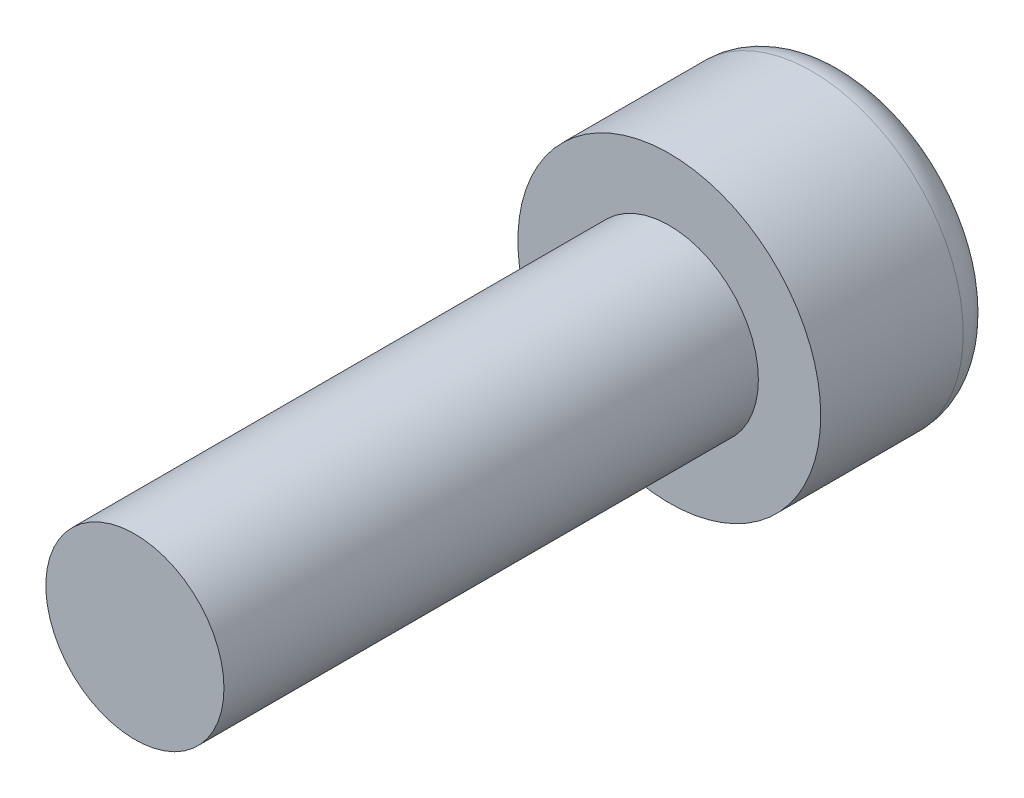
ISO-10303-21;
HEADER;
FILE_DESCRIPTION(('STEP AP214'),'2;1');
FILE_NAME('part.step','',(''),(''),'','','');
FILE_SCHEMA(('AUTOMOTIVE_DESIGN { 1 0 10303 214 1 1 1 1 }'));
ENDSEC;
DATA;
#1=APPLICATION_CONTEXT('core data for automotive mechanical design processes');
#2=APPLICATION_PROTOCOL_DEFINITION('international standard','automotive_design',2000,#1);
#3=PRODUCT_CONTEXT('',#1,'mechanical');
#4=PRODUCT('Part','Part','',(#3));
#5=PRODUCT_RELATED_PRODUCT_CATEGORY('part','',(#4));
#6=PRODUCT_DEFINITION_FORMATION('','',#4);
#7=PRODUCT_DEFINITION_CONTEXT('part definition',#1,'design');
#8=PRODUCT_DEFINITION('design','',#6,#7);
#9=PRODUCT_DEFINITION_SHAPE('','',#8);
#10=(LENGTH_UNIT() NAMED_UNIT(*) SI_UNIT(.MILLI.,.METRE.));
#11=(NAMED_UNIT(*) PLANE_ANGLE_UNIT() SI_UNIT($,.RADIAN.));
#12=(NAMED_UNIT(*) SI_UNIT($,.STERADIAN.) SOLID_ANGLE_UNIT());
#13=UNCERTAINTY_MEASURE_WITH_UNIT(LENGTH_MEASURE(1.E-05),#10,'distance_accuracy_value','');
#14=(GEOMETRIC_REPRESENTATION_CONTEXT(3) GLOBAL_UNCERTAINTY_ASSIGNED_CONTEXT((#13)) GLOBAL_UNIT_ASSIGNED_CONTEXT((#10,
#11,#12)) REPRESENTATION_CONTEXT('',''));
#15=CARTESIAN_POINT('',(0.,0.,0.));
#16=DIRECTION('',(0.,0.,1.));
#17=DIRECTION('',(1.,0.,0.));
#18=AXIS2_PLACEMENT_3D('',#15,#16,#17);
#19=CARTESIAN_POINT('',(0.,0.,5.));
#20=DIRECTION('',(0.,0.,-1.));
#21=DIRECTION('',(-1.,0.,0.));
#22=AXIS2_PLACEMENT_3D('',#19,#20,#21);
#23=CYLINDRICAL_SURFACE('',#22,4.25);
#24=CARTESIAN_POINT('',(0.,0.,1.));
#25=DIRECTION('',(0.,0.,1.));
#26=DIRECTION('',(1.,0.,0.));
#27=AXIS2_PLACEMENT_3D('',#24,#25,#26);
#28=CIRCLE('',#27,4.25);
#29=CARTESIAN_POINT('',(4.25,0.,1.));
#30=VERTEX_POINT('',#29);
#31=EDGE_CURVE('E39',#30,#30,#28,.T.);
#32=ORIENTED_EDGE('',*,*,#31,.T.);
#33=EDGE_LOOP('',(#32));
#34=FACE_BOUND('',#33,.T.);
#35=CARTESIAN_POINT('',(0.,0.,5.));
#36=DIRECTION('',(0.,0.,1.));
#37=DIRECTION('',(1.,0.,0.));
#38=AXIS2_PLACEMENT_3D('',#35,#36,#37);
#39=CIRCLE('',#38,4.25);
#40=CARTESIAN_POINT('',(4.25,0.,5.));
#41=VERTEX_POINT('',#40);
#42=EDGE_CURVE('E47',#41,#41,#39,.T.);
#43=ORIENTED_EDGE('',*,*,#42,.F.);
#44=EDGE_LOOP('',(#43));
#45=FACE_BOUND('',#44,.T.);
#46=ADVANCED_FACE('F32',(#34,#45),#23,.T.);
#47=CARTESIAN_POINT('',(0.,0.,5.));
#48=DIRECTION('',(0.,0.,1.));
#49=DIRECTION('',(1.,0.,0.));
#50=AXIS2_PLACEMENT_3D('',#47,#48,#49);
#51=PLANE('',#50);
#52=CARTESIAN_POINT('',(0.,0.,5.));
#53=DIRECTION('',(0.,0.,1.));
#54=DIRECTION('',(1.,0.,0.));
#55=AXIS2_PLACEMENT_3D('',#52,#53,#54);
#56=CIRCLE('',#55,2.5);
#57=CARTESIAN_POINT('',(2.5,0.,5.));
#58=VERTEX_POINT('',#57);
#59=EDGE_CURVE('E43',#58,#58,#56,.T.);
#60=ORIENTED_EDGE('',*,*,#59,.F.);
#61=EDGE_LOOP('',(#60));
#62=FACE_BOUND('',#61,.T.);
#63=ORIENTED_EDGE('',*,*,#42,.T.);
#64=EDGE_LOOP('',(#63));
#65=FACE_BOUND('',#64,.T.);
#66=ADVANCED_FACE('F65',(#62,#65),#51,.T.);
#67=CARTESIAN_POINT('',(0.,0.,0.));
#68=DIRECTION('',(0.,0.,1.));
#69=DIRECTION('',(1.,0.,0.));
#70=AXIS2_PLACEMENT_3D('',#67,#68,#69);
#71=PLANE('',#70);
#72=CARTESIAN_POINT('',(0.,0.,0.));
#73=DIRECTION('',(0.,0.,1.));
#74=DIRECTION('',(1.,0.,0.));
#75=AXIS2_PLACEMENT_3D('',#72,#73,#74);
#76=CIRCLE('',#75,3.25);
#77=CARTESIAN_POINT('',(3.25,0.,0.));
#78=VERTEX_POINT('',#77);
#79=EDGE_CURVE('E10',#78,#78,#76,.F.);
#80=ORIENTED_EDGE('',*,*,#79,.T.);
#81=EDGE_LOOP('',(#80));
#82=FACE_BOUND('',#81,.T.);
#83=ADVANCED_FACE('F61',(#82),#71,.F.);
#84=CARTESIAN_POINT('',(0.,0.,20.));
#85=DIRECTION('',(0.,0.,-1.));
#86=DIRECTION('',(-1.,0.,0.));
#87=AXIS2_PLACEMENT_3D('',#84,#85,#86);
#88=CYLINDRICAL_SURFACE('',#87,2.5);
#89=CARTESIAN_POINT('',(0.,0.,20.));
#90=DIRECTION('',(0.,0.,1.));
#91=DIRECTION('',(1.,0.,0.));
#92=AXIS2_PLACEMENT_3D('',#89,#90,#91);
#93=CIRCLE('',#92,2.5);
#94=CARTESIAN_POINT('',(2.5,0.,20.));
#95=VERTEX_POINT('',#94);
#96=EDGE_CURVE('E51',#95,#95,#93,.T.);
#97=ORIENTED_EDGE('',*,*,#96,.F.);
#98=EDGE_LOOP('',(#97));
#99=FACE_BOUND('',#98,.T.);
#100=ORIENTED_EDGE('',*,*,#59,.T.);
#101=EDGE_LOOP('',(#100));
#102=FACE_BOUND('',#101,.T.);
#103=ADVANCED_FACE('F58',(#99,#102),#88,.T.);
#104=CARTESIAN_POINT('',(0.,0.,20.));
#105=DIRECTION('',(0.,0.,1.));
#106=DIRECTION('',(1.,0.,0.));
#107=AXIS2_PLACEMENT_3D('',#104,#105,#106);
#108=PLANE('',#107);
#109=ORIENTED_EDGE('',*,*,#96,.T.);
#110=EDGE_LOOP('',(#109));
#111=FACE_BOUND('',#110,.T.);
#112=ADVANCED_FACE('F56',(#111),#108,.T.);
#113=CARTESIAN_POINT('',(0.,0.,1.));
#114=DIRECTION('',(0.,0.,1.));
#115=DIRECTION('',(1.,0.,0.));
#116=AXIS2_PLACEMENT_3D('',#113,#114,#115);
#117=TOROIDAL_SURFACE('',#116,3.25,1.);
#118=ORIENTED_EDGE('',*,*,#79,.F.);
#119=EDGE_LOOP('',(#118));
#120=FACE_BOUND('',#119,.T.);
#121=ORIENTED_EDGE('',*,*,#31,.F.);
#122=EDGE_LOOP('',(#121));
#123=FACE_BOUND('',#122,.T.);
#124=ADVANCED_FACE('F34',(#120,#123),#117,.T.);
#125=CLOSED_SHELL('',(#46,#66,#83,#103,#112,#124));
#126=MANIFOLD_SOLID_BREP('B2',#125);
#127=ADVANCED_BREP_SHAPE_REPRESENTATION('',(#18,#126),#14);
#128=SHAPE_DEFINITION_REPRESENTATION(#9,#127);
ENDSEC;
END-ISO-10303-21;
